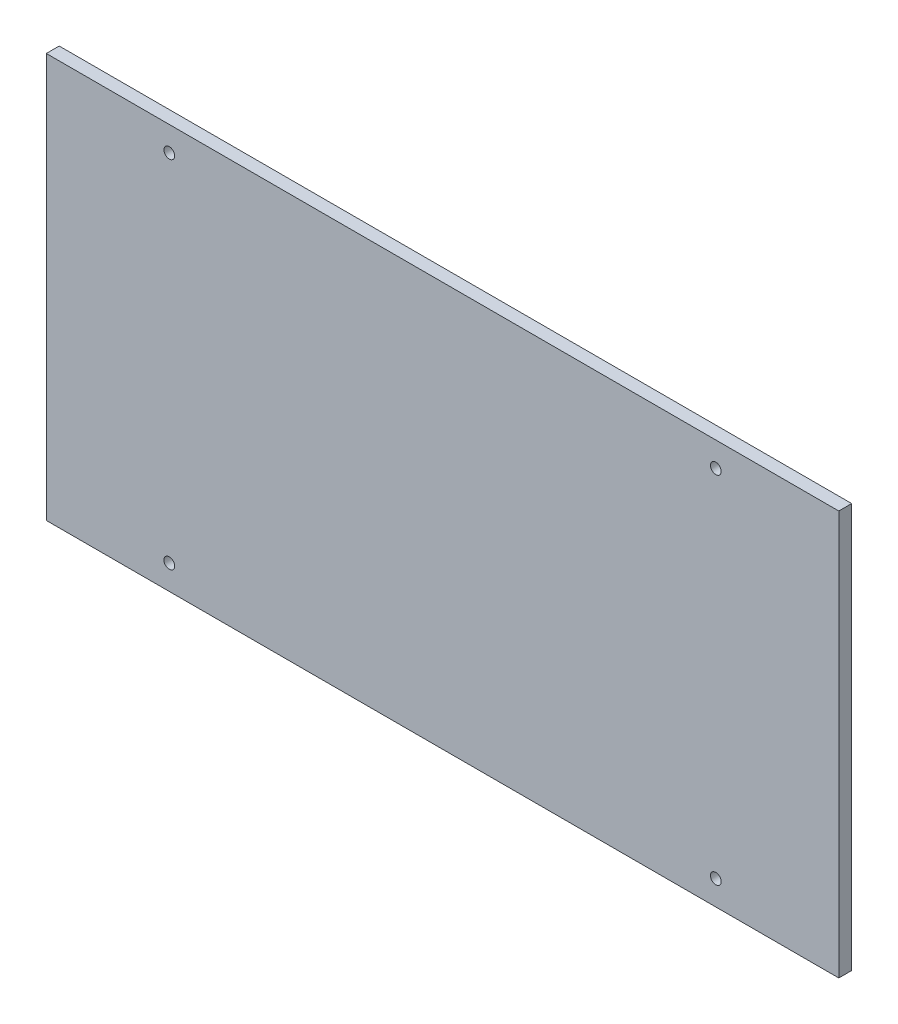
ISO-10303-21;
HEADER;
FILE_DESCRIPTION(('STEP AP214'),'2;1');
FILE_NAME('part.step','',(''),(''),'','','');
FILE_SCHEMA(('AUTOMOTIVE_DESIGN { 1 0 10303 214 1 1 1 1 }'));
ENDSEC;
DATA;
#1=APPLICATION_CONTEXT('core data for automotive mechanical design processes');
#2=APPLICATION_PROTOCOL_DEFINITION('international standard','automotive_design',2000,#1);
#3=PRODUCT_CONTEXT('',#1,'mechanical');
#4=PRODUCT('Part','Part','',(#3));
#5=PRODUCT_RELATED_PRODUCT_CATEGORY('part','',(#4));
#6=PRODUCT_DEFINITION_FORMATION('','',#4);
#7=PRODUCT_DEFINITION_CONTEXT('part definition',#1,'design');
#8=PRODUCT_DEFINITION('design','',#6,#7);
#9=PRODUCT_DEFINITION_SHAPE('','',#8);
#10=(LENGTH_UNIT() NAMED_UNIT(*) SI_UNIT(.MILLI.,.METRE.));
#11=(NAMED_UNIT(*) PLANE_ANGLE_UNIT() SI_UNIT($,.RADIAN.));
#12=(NAMED_UNIT(*) SI_UNIT($,.STERADIAN.) SOLID_ANGLE_UNIT());
#13=UNCERTAINTY_MEASURE_WITH_UNIT(LENGTH_MEASURE(1.E-05),#10,'distance_accuracy_value','');
#14=(GEOMETRIC_REPRESENTATION_CONTEXT(3) GLOBAL_UNCERTAINTY_ASSIGNED_CONTEXT((#13)) GLOBAL_UNIT_ASSIGNED_CONTEXT((#10,
#11,#12)) REPRESENTATION_CONTEXT('',''));
#15=CARTESIAN_POINT('',(0.,0.,0.));
#16=DIRECTION('',(0.,0.,1.));
#17=DIRECTION('',(1.,0.,0.));
#18=AXIS2_PLACEMENT_3D('',#15,#16,#17);
#19=CARTESIAN_POINT('',(0.,0.,3.));
#20=DIRECTION('',(0.,0.,-1.));
#21=DIRECTION('',(-1.,0.,0.));
#22=AXIS2_PLACEMENT_3D('',#19,#20,#21);
#23=PLANE('',#22);
#24=DIRECTION('',(0.,1.,0.));
#25=VECTOR('',#24,1.);
#26=CARTESIAN_POINT('',(92.075,-46.99,3.));
#27=LINE('',#26,#25);
#28=CARTESIAN_POINT('',(92.075,-46.99,3.));
#29=VERTEX_POINT('',#28);
#30=CARTESIAN_POINT('',(92.075,46.99,3.));
#31=VERTEX_POINT('',#30);
#32=EDGE_CURVE('E96',#29,#31,#27,.T.);
#33=ORIENTED_EDGE('',*,*,#32,.T.);
#34=DIRECTION('',(-1.,0.,0.));
#35=VECTOR('',#34,1.);
#36=CARTESIAN_POINT('',(-92.075,46.99,3.));
#37=LINE('',#36,#35);
#38=CARTESIAN_POINT('',(-92.075,46.99,3.));
#39=VERTEX_POINT('',#38);
#40=EDGE_CURVE('E91',#31,#39,#37,.T.);
#41=ORIENTED_EDGE('',*,*,#40,.T.);
#42=DIRECTION('',(0.,-1.,0.));
#43=VECTOR('',#42,1.);
#44=CARTESIAN_POINT('',(-92.075,-46.99,3.));
#45=LINE('',#44,#43);
#46=CARTESIAN_POINT('',(-92.075,-46.99,3.));
#47=VERTEX_POINT('',#46);
#48=EDGE_CURVE('E94',#39,#47,#45,.T.);
#49=ORIENTED_EDGE('',*,*,#48,.T.);
#50=DIRECTION('',(1.,0.,0.));
#51=VECTOR('',#50,1.);
#52=CARTESIAN_POINT('',(-92.075,-46.99,3.));
#53=LINE('',#52,#51);
#54=EDGE_CURVE('E61',#47,#29,#53,.T.);
#55=ORIENTED_EDGE('',*,*,#54,.T.);
#56=EDGE_LOOP('',(#33,#41,#49,#55));
#57=FACE_BOUND('',#56,.T.);
#58=CARTESIAN_POINT('',(-63.5,41.275,3.));
#59=DIRECTION('',(0.,0.,1.));
#60=DIRECTION('',(1.,0.,0.));
#61=AXIS2_PLACEMENT_3D('',#58,#59,#60);
#62=CIRCLE('',#61,1.25);
#63=CARTESIAN_POINT('',(-62.25,41.275,3.));
#64=VERTEX_POINT('',#63);
#65=EDGE_CURVE('E116',#64,#64,#62,.T.);
#66=ORIENTED_EDGE('',*,*,#65,.F.);
#67=EDGE_LOOP('',(#66));
#68=FACE_BOUND('',#67,.T.);
#69=CARTESIAN_POINT('',(63.5,-41.275,3.));
#70=DIRECTION('',(0.,0.,1.));
#71=DIRECTION('',(1.,0.,0.));
#72=AXIS2_PLACEMENT_3D('',#69,#70,#71);
#73=CIRCLE('',#72,1.25);
#74=CARTESIAN_POINT('',(64.75,-41.275,3.));
#75=VERTEX_POINT('',#74);
#76=EDGE_CURVE('E138',#75,#75,#73,.T.);
#77=ORIENTED_EDGE('',*,*,#76,.F.);
#78=EDGE_LOOP('',(#77));
#79=FACE_BOUND('',#78,.T.);
#80=CARTESIAN_POINT('',(-63.5,-41.275,3.));
#81=DIRECTION('',(0.,0.,1.));
#82=DIRECTION('',(1.,0.,0.));
#83=AXIS2_PLACEMENT_3D('',#80,#81,#82);
#84=CIRCLE('',#83,1.25);
#85=CARTESIAN_POINT('',(-62.25,-41.275,3.));
#86=VERTEX_POINT('',#85);
#87=EDGE_CURVE('E146',#86,#86,#84,.T.);
#88=ORIENTED_EDGE('',*,*,#87,.F.);
#89=EDGE_LOOP('',(#88));
#90=FACE_BOUND('',#89,.T.);
#91=CARTESIAN_POINT('',(63.5,41.275,3.));
#92=DIRECTION('',(0.,0.,1.));
#93=DIRECTION('',(1.,0.,0.));
#94=AXIS2_PLACEMENT_3D('',#91,#92,#93);
#95=CIRCLE('',#94,1.25);
#96=CARTESIAN_POINT('',(64.75,41.275,3.));
#97=VERTEX_POINT('',#96);
#98=EDGE_CURVE('E154',#97,#97,#95,.T.);
#99=ORIENTED_EDGE('',*,*,#98,.F.);
#100=EDGE_LOOP('',(#99));
#101=FACE_BOUND('',#100,.T.);
#102=ADVANCED_FACE('F43',(#57,#68,#79,#90,#101),#23,.F.);
#103=CARTESIAN_POINT('',(0.,0.,0.));
#104=DIRECTION('',(0.,0.,-1.));
#105=DIRECTION('',(-1.,0.,0.));
#106=AXIS2_PLACEMENT_3D('',#103,#104,#105);
#107=PLANE('',#106);
#108=CARTESIAN_POINT('',(-63.5,-41.275,0.));
#109=DIRECTION('',(0.,0.,1.));
#110=DIRECTION('',(1.,0.,0.));
#111=AXIS2_PLACEMENT_3D('',#108,#109,#110);
#112=CIRCLE('',#111,1.25);
#113=CARTESIAN_POINT('',(-62.25,-41.275,0.));
#114=VERTEX_POINT('',#113);
#115=EDGE_CURVE('E150',#114,#114,#112,.T.);
#116=ORIENTED_EDGE('',*,*,#115,.T.);
#117=EDGE_LOOP('',(#116));
#118=FACE_BOUND('',#117,.T.);
#119=CARTESIAN_POINT('',(-63.5,41.275,0.));
#120=DIRECTION('',(0.,0.,1.));
#121=DIRECTION('',(1.,0.,0.));
#122=AXIS2_PLACEMENT_3D('',#119,#120,#121);
#123=CIRCLE('',#122,1.25);
#124=CARTESIAN_POINT('',(-62.25,41.275,0.));
#125=VERTEX_POINT('',#124);
#126=EDGE_CURVE('E134',#125,#125,#123,.T.);
#127=ORIENTED_EDGE('',*,*,#126,.T.);
#128=EDGE_LOOP('',(#127));
#129=FACE_BOUND('',#128,.T.);
#130=DIRECTION('',(0.,1.,0.));
#131=VECTOR('',#130,1.);
#132=CARTESIAN_POINT('',(92.075,-46.99,0.));
#133=LINE('',#132,#131);
#134=CARTESIAN_POINT('',(92.075,-46.99,0.));
#135=VERTEX_POINT('',#134);
#136=CARTESIAN_POINT('',(92.075,46.99,0.));
#137=VERTEX_POINT('',#136);
#138=EDGE_CURVE('E112',#135,#137,#133,.T.);
#139=ORIENTED_EDGE('',*,*,#138,.F.);
#140=DIRECTION('',(1.,0.,0.));
#141=VECTOR('',#140,1.);
#142=CARTESIAN_POINT('',(-92.075,-46.99,0.));
#143=LINE('',#142,#141);
#144=CARTESIAN_POINT('',(-92.075,-46.99,0.));
#145=VERTEX_POINT('',#144);
#146=EDGE_CURVE('E84',#145,#135,#143,.T.);
#147=ORIENTED_EDGE('',*,*,#146,.F.);
#148=DIRECTION('',(0.,-1.,0.));
#149=VECTOR('',#148,1.);
#150=CARTESIAN_POINT('',(-92.075,-46.99,0.));
#151=LINE('',#150,#149);
#152=CARTESIAN_POINT('',(-92.075,46.99,0.));
#153=VERTEX_POINT('',#152);
#154=EDGE_CURVE('E78',#153,#145,#151,.T.);
#155=ORIENTED_EDGE('',*,*,#154,.F.);
#156=DIRECTION('',(-1.,0.,0.));
#157=VECTOR('',#156,1.);
#158=CARTESIAN_POINT('',(-92.075,46.99,0.));
#159=LINE('',#158,#157);
#160=EDGE_CURVE('E101',#137,#153,#159,.T.);
#161=ORIENTED_EDGE('',*,*,#160,.F.);
#162=EDGE_LOOP('',(#139,#147,#155,#161));
#163=FACE_BOUND('',#162,.T.);
#164=CARTESIAN_POINT('',(63.5,-41.275,0.));
#165=DIRECTION('',(0.,0.,1.));
#166=DIRECTION('',(1.,0.,0.));
#167=AXIS2_PLACEMENT_3D('',#164,#165,#166);
#168=CIRCLE('',#167,1.25);
#169=CARTESIAN_POINT('',(64.75,-41.275,0.));
#170=VERTEX_POINT('',#169);
#171=EDGE_CURVE('E142',#170,#170,#168,.T.);
#172=ORIENTED_EDGE('',*,*,#171,.T.);
#173=EDGE_LOOP('',(#172));
#174=FACE_BOUND('',#173,.T.);
#175=CARTESIAN_POINT('',(63.5,41.275,0.));
#176=DIRECTION('',(0.,0.,1.));
#177=DIRECTION('',(1.,0.,0.));
#178=AXIS2_PLACEMENT_3D('',#175,#176,#177);
#179=CIRCLE('',#178,1.25);
#180=CARTESIAN_POINT('',(64.75,41.275,0.));
#181=VERTEX_POINT('',#180);
#182=EDGE_CURVE('E158',#181,#181,#179,.T.);
#183=ORIENTED_EDGE('',*,*,#182,.T.);
#184=EDGE_LOOP('',(#183));
#185=FACE_BOUND('',#184,.T.);
#186=ADVANCED_FACE('F129',(#118,#129,#163,#174,#185),#107,.T.);
#187=CARTESIAN_POINT('',(92.075,-46.99,3.));
#188=DIRECTION('',(-1.,0.,0.));
#189=DIRECTION('',(0.,0.,1.));
#190=AXIS2_PLACEMENT_3D('',#187,#188,#189);
#191=PLANE('',#190);
#192=ORIENTED_EDGE('',*,*,#138,.T.);
#193=DIRECTION('',(0.,0.,-1.));
#194=VECTOR('',#193,1.);
#195=CARTESIAN_POINT('',(92.075,46.99,3.));
#196=LINE('',#195,#194);
#197=EDGE_CURVE('E11',#31,#137,#196,.T.);
#198=ORIENTED_EDGE('',*,*,#197,.F.);
#199=ORIENTED_EDGE('',*,*,#32,.F.);
#200=DIRECTION('',(0.,0.,-1.));
#201=VECTOR('',#200,1.);
#202=CARTESIAN_POINT('',(92.075,-46.99,3.));
#203=LINE('',#202,#201);
#204=EDGE_CURVE('E108',#29,#135,#203,.T.);
#205=ORIENTED_EDGE('',*,*,#204,.T.);
#206=EDGE_LOOP('',(#192,#198,#199,#205));
#207=FACE_BOUND('',#206,.T.);
#208=ADVANCED_FACE('F45',(#207),#191,.F.);
#209=CARTESIAN_POINT('',(-92.075,46.99,3.));
#210=DIRECTION('',(0.,-1.,0.));
#211=DIRECTION('',(0.,0.,-1.));
#212=AXIS2_PLACEMENT_3D('',#209,#210,#211);
#213=PLANE('',#212);
#214=ORIENTED_EDGE('',*,*,#160,.T.);
#215=DIRECTION('',(0.,0.,-1.));
#216=VECTOR('',#215,1.);
#217=CARTESIAN_POINT('',(-92.075,46.99,3.));
#218=LINE('',#217,#216);
#219=EDGE_CURVE('E53',#39,#153,#218,.T.);
#220=ORIENTED_EDGE('',*,*,#219,.F.);
#221=ORIENTED_EDGE('',*,*,#40,.F.);
#222=ORIENTED_EDGE('',*,*,#197,.T.);
#223=EDGE_LOOP('',(#214,#220,#221,#222));
#224=FACE_BOUND('',#223,.T.);
#225=ADVANCED_FACE('F100',(#224),#213,.F.);
#226=CARTESIAN_POINT('',(-92.075,-46.99,3.));
#227=DIRECTION('',(1.,0.,0.));
#228=DIRECTION('',(0.,0.,-1.));
#229=AXIS2_PLACEMENT_3D('',#226,#227,#228);
#230=PLANE('',#229);
#231=ORIENTED_EDGE('',*,*,#154,.T.);
#232=DIRECTION('',(0.,0.,-1.));
#233=VECTOR('',#232,1.);
#234=CARTESIAN_POINT('',(-92.075,-46.99,3.));
#235=LINE('',#234,#233);
#236=EDGE_CURVE('E103',#47,#145,#235,.T.);
#237=ORIENTED_EDGE('',*,*,#236,.F.);
#238=ORIENTED_EDGE('',*,*,#48,.F.);
#239=ORIENTED_EDGE('',*,*,#219,.T.);
#240=EDGE_LOOP('',(#231,#237,#238,#239));
#241=FACE_BOUND('',#240,.T.);
#242=ADVANCED_FACE('F104',(#241),#230,.F.);
#243=CARTESIAN_POINT('',(-92.075,-46.99,3.));
#244=DIRECTION('',(0.,1.,0.));
#245=DIRECTION('',(0.,0.,1.));
#246=AXIS2_PLACEMENT_3D('',#243,#244,#245);
#247=PLANE('',#246);
#248=ORIENTED_EDGE('',*,*,#146,.T.);
#249=ORIENTED_EDGE('',*,*,#204,.F.);
#250=ORIENTED_EDGE('',*,*,#54,.F.);
#251=ORIENTED_EDGE('',*,*,#236,.T.);
#252=EDGE_LOOP('',(#248,#249,#250,#251));
#253=FACE_BOUND('',#252,.T.);
#254=ADVANCED_FACE('F126',(#253),#247,.F.);
#255=CARTESIAN_POINT('',(-63.5,41.275,3.));
#256=DIRECTION('',(0.,0.,-1.));
#257=DIRECTION('',(-1.,0.,0.));
#258=AXIS2_PLACEMENT_3D('',#255,#256,#257);
#259=CYLINDRICAL_SURFACE('',#258,1.25);
#260=ORIENTED_EDGE('',*,*,#65,.T.);
#261=EDGE_LOOP('',(#260));
#262=FACE_BOUND('',#261,.T.);
#263=ORIENTED_EDGE('',*,*,#126,.F.);
#264=EDGE_LOOP('',(#263));
#265=FACE_BOUND('',#264,.T.);
#266=ADVANCED_FACE('F177',(#262,#265),#259,.F.);
#267=CARTESIAN_POINT('',(63.5,-41.275,3.));
#268=DIRECTION('',(0.,0.,-1.));
#269=DIRECTION('',(-1.,0.,0.));
#270=AXIS2_PLACEMENT_3D('',#267,#268,#269);
#271=CYLINDRICAL_SURFACE('',#270,1.25);
#272=ORIENTED_EDGE('',*,*,#76,.T.);
#273=EDGE_LOOP('',(#272));
#274=FACE_BOUND('',#273,.T.);
#275=ORIENTED_EDGE('',*,*,#171,.F.);
#276=EDGE_LOOP('',(#275));
#277=FACE_BOUND('',#276,.T.);
#278=ADVANCED_FACE('F231',(#274,#277),#271,.F.);
#279=CARTESIAN_POINT('',(-63.5,-41.275,3.));
#280=DIRECTION('',(0.,0.,-1.));
#281=DIRECTION('',(-1.,0.,0.));
#282=AXIS2_PLACEMENT_3D('',#279,#280,#281);
#283=CYLINDRICAL_SURFACE('',#282,1.25);
#284=ORIENTED_EDGE('',*,*,#87,.T.);
#285=EDGE_LOOP('',(#284));
#286=FACE_BOUND('',#285,.T.);
#287=ORIENTED_EDGE('',*,*,#115,.F.);
#288=EDGE_LOOP('',(#287));
#289=FACE_BOUND('',#288,.T.);
#290=ADVANCED_FACE('F240',(#286,#289),#283,.F.);
#291=CARTESIAN_POINT('',(63.5,41.275,3.));
#292=DIRECTION('',(0.,0.,-1.));
#293=DIRECTION('',(-1.,0.,0.));
#294=AXIS2_PLACEMENT_3D('',#291,#292,#293);
#295=CYLINDRICAL_SURFACE('',#294,1.25);
#296=ORIENTED_EDGE('',*,*,#98,.T.);
#297=EDGE_LOOP('',(#296));
#298=FACE_BOUND('',#297,.T.);
#299=ORIENTED_EDGE('',*,*,#182,.F.);
#300=EDGE_LOOP('',(#299));
#301=FACE_BOUND('',#300,.T.);
#302=ADVANCED_FACE('F166',(#298,#301),#295,.F.);
#303=CLOSED_SHELL('',(#102,#186,#208,#225,#242,#254,#266,#278,#290,#302));
#304=MANIFOLD_SOLID_BREP('B2',#303);
#305=ADVANCED_BREP_SHAPE_REPRESENTATION('',(#18,#304),#14);
#306=SHAPE_DEFINITION_REPRESENTATION(#9,#305);
ENDSEC;
END-ISO-10303-21;
